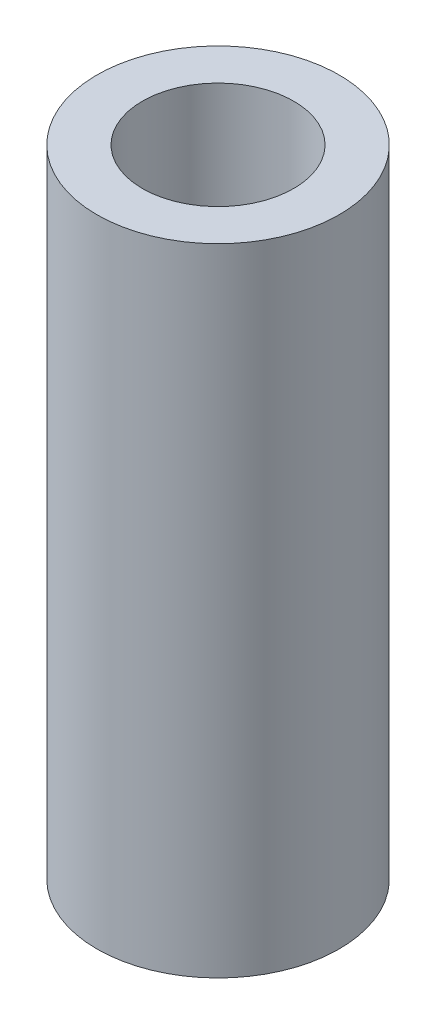
ISO-10303-21;
HEADER;
FILE_DESCRIPTION(('STEP AP214'),'2;1');
FILE_NAME('part.step','',(''),(''),'','','');
FILE_SCHEMA(('AUTOMOTIVE_DESIGN { 1 0 10303 214 1 1 1 1 }'));
ENDSEC;
DATA;
#1=APPLICATION_CONTEXT('core data for automotive mechanical design processes');
#2=APPLICATION_PROTOCOL_DEFINITION('international standard','automotive_design',2000,#1);
#3=PRODUCT_CONTEXT('',#1,'mechanical');
#4=PRODUCT('Part','Part','',(#3));
#5=PRODUCT_RELATED_PRODUCT_CATEGORY('part','',(#4));
#6=PRODUCT_DEFINITION_FORMATION('','',#4);
#7=PRODUCT_DEFINITION_CONTEXT('part definition',#1,'design');
#8=PRODUCT_DEFINITION('design','',#6,#7);
#9=PRODUCT_DEFINITION_SHAPE('','',#8);
#10=(LENGTH_UNIT() NAMED_UNIT(*) SI_UNIT(.MILLI.,.METRE.));
#11=(NAMED_UNIT(*) PLANE_ANGLE_UNIT() SI_UNIT($,.RADIAN.));
#12=(NAMED_UNIT(*) SI_UNIT($,.STERADIAN.) SOLID_ANGLE_UNIT());
#13=UNCERTAINTY_MEASURE_WITH_UNIT(LENGTH_MEASURE(1.E-05),#10,'distance_accuracy_value','');
#14=(GEOMETRIC_REPRESENTATION_CONTEXT(3) GLOBAL_UNCERTAINTY_ASSIGNED_CONTEXT((#13)) GLOBAL_UNIT_ASSIGNED_CONTEXT((#10,
#11,#12)) REPRESENTATION_CONTEXT('',''));
#15=CARTESIAN_POINT('',(0.,0.,0.));
#16=DIRECTION('',(0.,0.,1.));
#17=DIRECTION('',(1.,0.,0.));
#18=AXIS2_PLACEMENT_3D('',#15,#16,#17);
#19=CARTESIAN_POINT('',(0.,21.,0.));
#20=DIRECTION('',(0.,-1.,0.));
#21=DIRECTION('',(0.,0.,-1.));
#22=AXIS2_PLACEMENT_3D('',#19,#20,#21);
#23=CYLINDRICAL_SURFACE('',#22,4.);
#24=DIRECTION('',(0.,-1.,0.));
#25=VECTOR('',#24,1.);
#26=CARTESIAN_POINT('',(-3.99991645107305,21.,-0.0258531320189111));
#27=LINE('',#26,#25);
#28=CARTESIAN_POINT('',(-3.99991645107308,17.399761270919,-0.025853132018911));
#29=VERTEX_POINT('',#28);
#30=CARTESIAN_POINT('',(-3.99991645107308,14.600238729081,-0.025853132018911));
#31=VERTEX_POINT('',#30);
#32=EDGE_CURVE('E11',#29,#31,#27,.T.);
#33=ORIENTED_EDGE('',*,*,#32,.T.);
#34=CARTESIAN_POINT('',(-3.99991645107308,14.600238729081,-0.0258531320190421));
#35=CARTESIAN_POINT('',(-3.99967225830139,14.6009439988238,-0.0640921575293315));
#36=CARTESIAN_POINT('',(-3.99887347610365,14.6032187619792,-0.102278964228953));
#37=CARTESIAN_POINT('',(-3.99620499133585,14.6108738995903,-0.178292419562263));
#38=CARTESIAN_POINT('',(-3.99433556857381,14.6162534626206,-0.216119159673172));
#39=CARTESIAN_POINT('',(-3.98719610185074,14.6369488008378,-0.328422064505284));
#40=CARTESIAN_POINT('',(-3.98039240823535,14.6568271415164,-0.402013757078062));
#41=CARTESIAN_POINT('',(-3.96340813940453,14.7080320373958,-0.544576356502268));
#42=CARTESIAN_POINT('',(-3.95322930854667,14.7393526797706,-0.613549628185836));
#43=CARTESIAN_POINT('',(-3.93052020660311,14.8124834378182,-0.745307835813629));
#44=CARTESIAN_POINT('',(-3.91798857048058,14.8542996475161,-0.808089146927107));
#45=CARTESIAN_POINT('',(-3.89135352945277,14.9489240346771,-0.928050448785724));
#46=CARTESIAN_POINT('',(-3.8772106603566,15.0020634331421,-0.984960294435631));
#47=CARTESIAN_POINT('',(-3.84921378824501,15.1170764566808,-1.08925407411135));
#48=CARTESIAN_POINT('',(-3.83535986056662,15.1789523277724,-1.1366355509169));
#49=CARTESIAN_POINT('',(-3.80908699514521,15.3118854332206,-1.22184578759158));
#50=CARTESIAN_POINT('',(-3.79672101385227,15.3831561146456,-1.2593593716383));
#51=CARTESIAN_POINT('',(-3.77546131742445,15.5315120212514,-1.32173627746362));
#52=CARTESIAN_POINT('',(-3.76656616175619,15.6085948182841,-1.34660484873724));
#53=CARTESIAN_POINT('',(-3.75372261689463,15.7631109656046,-1.38199497149599));
#54=CARTESIAN_POINT('',(-3.74958979642407,15.840405738016,-1.39305292756278));
#55=CARTESIAN_POINT('',(-3.74619639341714,15.9958548095515,-1.40215536416123));
#56=CARTESIAN_POINT('',(-3.74693437342952,16.0740088482956,-1.40020368404321));
#57=CARTESIAN_POINT('',(-3.75302260858192,16.2249354068714,-1.38379454669174));
#58=CARTESIAN_POINT('',(-3.75814713768332,16.2977849538027,-1.36994900946075));
#59=CARTESIAN_POINT('',(-3.77208656020989,16.440062954669,-1.33108421220736));
#60=CARTESIAN_POINT('',(-3.78090196998585,16.5094909284095,-1.30606338874007));
#61=CARTESIAN_POINT('',(-3.8014547569224,16.6446909983725,-1.24498869082329));
#62=CARTESIAN_POINT('',(-3.81325163509311,16.7103504237503,-1.20870621983939));
#63=CARTESIAN_POINT('',(-3.83839332211351,16.8348584792766,-1.12631614578102));
#64=CARTESIAN_POINT('',(-3.85173858055954,16.8937051212682,-1.08020568572731));
#65=CARTESIAN_POINT('',(-3.87940616234065,17.0064550711861,-0.976347097309243));
#66=CARTESIAN_POINT('',(-3.89374063509772,17.0598814916565,-0.918083294265943));
#67=CARTESIAN_POINT('',(-3.92108981098457,17.156325832214,-0.79318088663264));
#68=CARTESIAN_POINT('',(-3.93410407430078,17.1993402902396,-0.726539507591292));
#69=CARTESIAN_POINT('',(-3.95748807810665,17.2739625280279,-0.586005200561402));
#70=CARTESIAN_POINT('',(-3.96783560070064,17.3054753314649,-0.51205802975848));
#71=CARTESIAN_POINT('',(-3.98454566226436,17.3554207033291,-0.359510885329969));
#72=CARTESIAN_POINT('',(-3.99091545014645,17.3738770736394,-0.280919662805801));
#73=CARTESIAN_POINT('',(-3.9963966045933,17.3896748938166,-0.172255891920458));
#74=CARTESIAN_POINT('',(-3.99754872485567,17.3929825667261,-0.143056897965824));
#75=CARTESIAN_POINT('',(-3.99921326658427,17.39775252398,-0.0845341011151192));
#76=CARTESIAN_POINT('',(-3.99972663497742,17.3992175400328,-0.0552105477894228));
#77=CARTESIAN_POINT('',(-3.99991645107305,17.399761270919,-0.0258531320190412));
#78=B_SPLINE_CURVE_WITH_KNOTS('',3,(#34,#35,#36,#37,#38,#39,#40,#41,#42,#43,#44,#45,#46,#47,#48,
#49,#50,#51,#52,#53,#54,#55,#56,#57,#58,#59,#60,#61,#62,#63,#64,#65,#66,#67,#68,#69,#70,#71,#72,
#73,#74,#75,#76,#77),.UNSPECIFIED.,.F.,.F.,(4,2,2,2,2,2,2,2,2,2,2,2,2,2,2,2,2,2,2,2,2,4),(0.,
0.114664507603254,0.229299061720669,0.457701131164789,0.685985340068443,0.9144024051538,
1.15074978367751,1.38715803462588,1.63038942015454,1.87351974714062,2.1068793264695,
2.34017004072909,2.56213147320374,2.78412396825833,3.01095516106762,3.23785238346189,
3.47775904339029,3.71774536497249,3.9596708177997,4.20115409590331,4.28932861164633,
4.37737225545862),.UNSPECIFIED.);
#79=EDGE_CURVE('E83',#31,#29,#78,.T.);
#80=ORIENTED_EDGE('',*,*,#79,.T.);
#81=EDGE_LOOP('',(#33,#80));
#82=FACE_BOUND('',#81,.T.);
#83=DIRECTION('',(0.,-1.,0.));
#84=VECTOR('',#83,1.);
#85=CARTESIAN_POINT('',(-3.99991645107305,21.,0.0258531320189111));
#86=LINE('',#85,#84);
#87=CARTESIAN_POINT('',(-3.99991645107308,14.600238729081,0.025853132018911));
#88=VERTEX_POINT('',#87);
#89=CARTESIAN_POINT('',(-3.99991645107308,17.399761270919,0.025853132018911));
#90=VERTEX_POINT('',#89);
#91=EDGE_CURVE('E45',#88,#90,#86,.F.);
#92=ORIENTED_EDGE('',*,*,#91,.T.);
#93=CARTESIAN_POINT('',(-3.99991645107308,17.399761270919,0.0258531320190421));
#94=CARTESIAN_POINT('',(-3.99967225830139,17.3990560011763,0.0640921575293312));
#95=CARTESIAN_POINT('',(-3.99887347610365,17.3967812380208,0.102278964228953));
#96=CARTESIAN_POINT('',(-3.99620499133585,17.3891261004098,0.178292419562263));
#97=CARTESIAN_POINT('',(-3.99433556857381,17.3837465373795,0.216119159673172));
#98=CARTESIAN_POINT('',(-3.98719610185074,17.3630511991623,0.328422064505283));
#99=CARTESIAN_POINT('',(-3.98039240823535,17.3431728584837,0.40201375707806));
#100=CARTESIAN_POINT('',(-3.96340813940453,17.2919679626042,0.544576356502268));
#101=CARTESIAN_POINT('',(-3.95322930854667,17.2606473202295,0.613549628185838));
#102=CARTESIAN_POINT('',(-3.93052020660311,17.1875165621819,0.74530783581363));
#103=CARTESIAN_POINT('',(-3.91798857048058,17.145700352484,0.808089146927105));
#104=CARTESIAN_POINT('',(-3.89135352945277,17.051075965323,0.928050448785722));
#105=CARTESIAN_POINT('',(-3.8772106603566,16.997936566858,0.98496029443563));
#106=CARTESIAN_POINT('',(-3.84921378824501,16.8829235433193,1.08925407411135));
#107=CARTESIAN_POINT('',(-3.83535986056663,16.8210476722277,1.13663555091689));
#108=CARTESIAN_POINT('',(-3.80908699514521,16.6881145667794,1.22184578759158));
#109=CARTESIAN_POINT('',(-3.79672101385227,16.6168438853544,1.25935937163829));
#110=CARTESIAN_POINT('',(-3.77546131742445,16.4684879787486,1.32173627746362));
#111=CARTESIAN_POINT('',(-3.76656616175619,16.391405181716,1.34660484873724));
#112=CARTESIAN_POINT('',(-3.75372261689463,16.2368890343955,1.38199497149599));
#113=CARTESIAN_POINT('',(-3.74958979642407,16.1595942619841,1.39305292756278));
#114=CARTESIAN_POINT('',(-3.74619639341714,16.0041451904485,1.40215536416123));
#115=CARTESIAN_POINT('',(-3.74693437342952,15.9259911517045,1.40020368404321));
#116=CARTESIAN_POINT('',(-3.75302260858192,15.7750645931286,1.38379454669174));
#117=CARTESIAN_POINT('',(-3.75814713768331,15.7022150461974,1.36994900946075));
#118=CARTESIAN_POINT('',(-3.77208656020989,15.5599370453311,1.33108421220736));
#119=CARTESIAN_POINT('',(-3.78090196998585,15.4905090715906,1.30606338874007));
#120=CARTESIAN_POINT('',(-3.8014547569224,15.3553090016275,1.24498869082329));
#121=CARTESIAN_POINT('',(-3.81325163509311,15.2896495762497,1.20870621983939));
#122=CARTESIAN_POINT('',(-3.83839332211351,15.1651415207234,1.12631614578102));
#123=CARTESIAN_POINT('',(-3.85173858055954,15.1062948787318,1.0802056857273));
#124=CARTESIAN_POINT('',(-3.87940616234065,14.993544928814,0.976347097309244));
#125=CARTESIAN_POINT('',(-3.89374063509773,14.9401185083435,0.918083294265944));
#126=CARTESIAN_POINT('',(-3.92108981098458,14.8436741677861,0.79318088663264));
#127=CARTESIAN_POINT('',(-3.93410407430078,14.8006597097605,0.726539507591293));
#128=CARTESIAN_POINT('',(-3.95748807810665,14.7260374719722,0.586005200561404));
#129=CARTESIAN_POINT('',(-3.96783560070064,14.6945246685351,0.512058029758483));
#130=CARTESIAN_POINT('',(-3.98454566226436,14.644579296671,0.359510885329972));
#131=CARTESIAN_POINT('',(-3.99091545014645,14.6261229263606,0.280919662805803));
#132=CARTESIAN_POINT('',(-3.9963966045933,14.6103251061834,0.17225589192046));
#133=CARTESIAN_POINT('',(-3.99754872485567,14.607017433274,0.143056897965826));
#134=CARTESIAN_POINT('',(-3.99921326658427,14.6022474760201,0.0845341011151206));
#135=CARTESIAN_POINT('',(-3.99972663497742,14.6007824599673,0.0552105477894235));
#136=CARTESIAN_POINT('',(-3.99991645107305,14.600238729081,0.0258531320190412));
#137=B_SPLINE_CURVE_WITH_KNOTS('',3,(#93,#94,#95,#96,#97,#98,#99,#100,#101,#102,#103,#104,#105,
#106,#107,#108,#109,#110,#111,#112,#113,#114,#115,#116,#117,#118,#119,#120,#121,#122,#123,#124,
#125,#126,#127,#128,#129,#130,#131,#132,#133,#134,#135,#136),.UNSPECIFIED.,.F.,.F.,(4,2,2,2,2,2,
2,2,2,2,2,2,2,2,2,2,2,2,2,2,2,4),(0.,0.114664507603254,0.229299061720668,0.457701131164788,
0.685985340068446,0.914402405153799,1.15074978367751,1.38715803462588,1.63038942015453,
1.87351974714062,2.1068793264695,2.34017004072909,2.56213147320374,2.78412396825833,
3.01095516106763,3.23785238346189,3.4777590433903,3.71774536497248,3.95967081779969,
4.20115409590331,4.28932861164633,4.37737225545862),.UNSPECIFIED.);
#138=EDGE_CURVE('E81',#90,#88,#137,.T.);
#139=ORIENTED_EDGE('',*,*,#138,.T.);
#140=EDGE_LOOP('',(#92,#139));
#141=FACE_BOUND('',#140,.T.);
#142=DIRECTION('',(0.,-1.,0.));
#143=VECTOR('',#142,1.);
#144=CARTESIAN_POINT('',(-3.99991645107305,21.,-0.0258531320189111));
#145=LINE('',#144,#143);
#146=CARTESIAN_POINT('',(-3.99991645107316,6.39976127091904,-0.025853132018911));
#147=VERTEX_POINT('',#146);
#148=CARTESIAN_POINT('',(-3.99991645107316,3.60023872908101,-0.025853132018911));
#149=VERTEX_POINT('',#148);
#150=EDGE_CURVE('E78',#147,#149,#145,.T.);
#151=ORIENTED_EDGE('',*,*,#150,.T.);
#152=CARTESIAN_POINT('',(-3.99991645107316,3.60023872908101,-0.0258531320189111));
#153=CARTESIAN_POINT('',(-3.99967225830142,3.60094399882377,-0.0640921575291983));
#154=CARTESIAN_POINT('',(-3.99887347610366,3.6032187619792,-0.102278964228819));
#155=CARTESIAN_POINT('',(-3.99620499133584,3.61087389959025,-0.178292419562128));
#156=CARTESIAN_POINT('',(-3.99433556857381,3.61625346262055,-0.216119159673037));
#157=CARTESIAN_POINT('',(-3.98719610185076,3.63694880083776,-0.328422064505149));
#158=CARTESIAN_POINT('',(-3.98039240823537,3.65682714151634,-0.402013757077929));
#159=CARTESIAN_POINT('',(-3.96340813940455,3.70803203739579,-0.544576356502139));
#160=CARTESIAN_POINT('',(-3.95322930854669,3.73935267977053,-0.61354962818571));
#161=CARTESIAN_POINT('',(-3.93052020660313,3.81248343781812,-0.745307835813509));
#162=CARTESIAN_POINT('',(-3.91798857048061,3.854299647516,-0.808089146926989));
#163=CARTESIAN_POINT('',(-3.8913535294528,3.94892403467695,-0.928050448785614));
#164=CARTESIAN_POINT('',(-3.87721066035663,4.00206343314195,-0.984960294435526));
#165=CARTESIAN_POINT('',(-3.84921378824504,4.11707645668067,-1.08925407411126));
#166=CARTESIAN_POINT('',(-3.83535986056665,4.17895232777225,-1.13663555091681));
#167=CARTESIAN_POINT('',(-3.80908699514523,4.31188543322051,-1.2218457875915));
#168=CARTESIAN_POINT('',(-3.79672101385229,4.38315611464547,-1.25935937163823));
#169=CARTESIAN_POINT('',(-3.77546131742447,4.53151202125127,-1.32173627746357));
#170=CARTESIAN_POINT('',(-3.76656616175621,4.60859481828395,-1.3466048487372));
#171=CARTESIAN_POINT('',(-3.75372261689464,4.76311096560443,-1.38199497149597));
#172=CARTESIAN_POINT('',(-3.74958979642408,4.84040573801585,-1.39305292756276));
#173=CARTESIAN_POINT('',(-3.74619639341714,4.99585480955136,-1.40215536416123));
#174=CARTESIAN_POINT('',(-3.74693437342952,5.07400884829543,-1.40020368404322));
#175=CARTESIAN_POINT('',(-3.75302260858191,5.22493540687129,-1.38379454669176));
#176=CARTESIAN_POINT('',(-3.7581471376833,5.29778495380255,-1.36994900946078));
#177=CARTESIAN_POINT('',(-3.77208656020987,5.44006295466883,-1.33108421220741));
#178=CARTESIAN_POINT('',(-3.78090196998583,5.50949092840937,-1.30606338874012));
#179=CARTESIAN_POINT('',(-3.80145475692238,5.6446909983724,-1.24498869082335));
#180=CARTESIAN_POINT('',(-3.81325163509309,5.71035042375019,-1.20870621983946));
#181=CARTESIAN_POINT('',(-3.83839332211348,5.83485847927652,-1.12631614578111));
#182=CARTESIAN_POINT('',(-3.85173858055951,5.8937051212681,-1.0802056857274));
#183=CARTESIAN_POINT('',(-3.87940616234062,6.00645507118598,-0.976347097309352));
#184=CARTESIAN_POINT('',(-3.8937406350977,6.05988149165643,-0.918083294266058));
#185=CARTESIAN_POINT('',(-3.92108981098455,6.15632583221387,-0.793180886632766));
#186=CARTESIAN_POINT('',(-3.93410407430075,6.19934029023948,-0.726539507591425));
#187=CARTESIAN_POINT('',(-3.95748807810663,6.27396252802781,-0.586005200561544));
#188=CARTESIAN_POINT('',(-3.96783560070062,6.30547533146489,-0.512058029758626));
#189=CARTESIAN_POINT('',(-3.98454566226434,6.35542070332904,-0.359510885330119));
#190=CARTESIAN_POINT('',(-3.99091545014644,6.37387707363939,-0.280919662805951));
#191=CARTESIAN_POINT('',(-3.9963966045933,6.3896748938166,-0.172255891920562));
#192=CARTESIAN_POINT('',(-3.99754872485567,6.3929825667261,-0.14305689796588));
#193=CARTESIAN_POINT('',(-3.99921326658427,6.39775252397999,-0.0845341011150808));
#194=CARTESIAN_POINT('',(-3.99972663497742,6.39921754003277,-0.0552105477893363));
#195=CARTESIAN_POINT('',(-3.99991645107305,6.39976127091905,-0.0258531320189066));
#196=B_SPLINE_CURVE_WITH_KNOTS('',3,(#152,#153,#154,#155,#156,#157,#158,#159,#160,#161,#162,
#163,#164,#165,#166,#167,#168,#169,#170,#171,#172,#173,#174,#175,#176,#177,#178,#179,#180,#181,
#182,#183,#184,#185,#186,#187,#188,#189,#190,#191,#192,#193,#194,#195),.UNSPECIFIED.,.F.,.F.,(4,
2,2,2,2,2,2,2,2,2,2,2,2,2,2,2,2,2,2,2,2,4),(0.,0.114664507603251,0.229299061720663,
0.457701131164782,0.685985340068434,0.914402405153786,1.15074978367749,1.38715803462586,
1.63038942015451,1.8735197471406,2.10687932646949,2.34017004072907,2.56213147320373,
2.78412396825832,3.01095516106761,3.23785238346187,3.47775904339027,3.71774536497246,
3.95967081779967,4.20115409590329,4.28932861164646,4.37737225545889),.UNSPECIFIED.);
#197=EDGE_CURVE('E222',#149,#147,#196,.T.);
#198=ORIENTED_EDGE('',*,*,#197,.T.);
#199=EDGE_LOOP('',(#151,#198));
#200=FACE_BOUND('',#199,.T.);
#201=DIRECTION('',(0.,-1.,0.));
#202=VECTOR('',#201,1.);
#203=CARTESIAN_POINT('',(-3.99991645107305,21.,0.0258531320189111));
#204=LINE('',#203,#202);
#205=CARTESIAN_POINT('',(-3.99991645107316,3.60023872908101,0.025853132018911));
#206=VERTEX_POINT('',#205);
#207=CARTESIAN_POINT('',(-3.99991645107316,6.39976127091904,0.025853132018911));
#208=VERTEX_POINT('',#207);
#209=EDGE_CURVE('E242',#206,#208,#204,.F.);
#210=ORIENTED_EDGE('',*,*,#209,.T.);
#211=CARTESIAN_POINT('',(-3.99991645107316,6.39976127091904,0.0258531320189111));
#212=CARTESIAN_POINT('',(-3.99967225830142,6.39905600117628,0.0640921575291982));
#213=CARTESIAN_POINT('',(-3.99887347610366,6.39678123802085,0.102278964228819));
#214=CARTESIAN_POINT('',(-3.99620499133584,6.38912610040981,0.178292419562127));
#215=CARTESIAN_POINT('',(-3.99433556857381,6.38374653737951,0.216119159673036));
#216=CARTESIAN_POINT('',(-3.98719610185076,6.3630511991623,0.328422064505149));
#217=CARTESIAN_POINT('',(-3.98039240823537,6.34317285848372,0.402013757077927));
#218=CARTESIAN_POINT('',(-3.96340813940455,6.29196796260427,0.544576356502137));
#219=CARTESIAN_POINT('',(-3.95322930854669,6.26064732022953,0.613549628185708));
#220=CARTESIAN_POINT('',(-3.93052020660313,6.18751656218193,0.745307835813506));
#221=CARTESIAN_POINT('',(-3.9179885704806,6.14570035248406,0.808089146926986));
#222=CARTESIAN_POINT('',(-3.8913535294528,6.0510759653231,0.928050448785611));
#223=CARTESIAN_POINT('',(-3.87721066035663,5.99793656685811,0.984960294435523));
#224=CARTESIAN_POINT('',(-3.84921378824504,5.88292354331939,1.08925407411126));
#225=CARTESIAN_POINT('',(-3.83535986056665,5.82104767222781,1.1366355509168));
#226=CARTESIAN_POINT('',(-3.80908699514524,5.68811456677954,1.2218457875915));
#227=CARTESIAN_POINT('',(-3.79672101385229,5.61684388535459,1.25935937163823));
#228=CARTESIAN_POINT('',(-3.77546131742447,5.46848797874879,1.32173627746357));
#229=CARTESIAN_POINT('',(-3.76656616175621,5.39140518171611,1.3466048487372));
#230=CARTESIAN_POINT('',(-3.75372261689464,5.23688903439562,1.38199497149597));
#231=CARTESIAN_POINT('',(-3.74958979642408,5.1595942619842,1.39305292756276));
#232=CARTESIAN_POINT('',(-3.74619639341714,5.00414519044869,1.40215536416123));
#233=CARTESIAN_POINT('',(-3.74693437342952,4.92599115170463,1.40020368404322));
#234=CARTESIAN_POINT('',(-3.75302260858191,4.77506459312876,1.38379454669176));
#235=CARTESIAN_POINT('',(-3.7581471376833,4.70221504619751,1.36994900946078));
#236=CARTESIAN_POINT('',(-3.77208656020987,4.55993704533122,1.33108421220741));
#237=CARTESIAN_POINT('',(-3.78090196998583,4.49050907159068,1.30606338874012));
#238=CARTESIAN_POINT('',(-3.80145475692238,4.35530900162765,1.24498869082335));
#239=CARTESIAN_POINT('',(-3.81325163509309,4.28964957624987,1.20870621983946));
#240=CARTESIAN_POINT('',(-3.83839332211348,4.16514152072353,1.12631614578111));
#241=CARTESIAN_POINT('',(-3.85173858055951,4.10629487873195,1.0802056857274));
#242=CARTESIAN_POINT('',(-3.87940616234062,3.99354492881407,0.976347097309353));
#243=CARTESIAN_POINT('',(-3.8937406350977,3.94011850834362,0.918083294266059));
#244=CARTESIAN_POINT('',(-3.92108981098455,3.84367416778618,0.793180886632768));
#245=CARTESIAN_POINT('',(-3.93410407430075,3.80065970976057,0.726539507591427));
#246=CARTESIAN_POINT('',(-3.95748807810663,3.72603747197224,0.586005200561547));
#247=CARTESIAN_POINT('',(-3.96783560070062,3.69452466853517,0.512058029758628));
#248=CARTESIAN_POINT('',(-3.98454566226434,3.64457929667102,0.359510885330122));
#249=CARTESIAN_POINT('',(-3.99091545014644,3.62612292636067,0.280919662805955));
#250=CARTESIAN_POINT('',(-3.9963966045933,3.61032510618346,0.172255891920565));
#251=CARTESIAN_POINT('',(-3.99754872485567,3.60701743327396,0.143056897965883));
#252=CARTESIAN_POINT('',(-3.99921326658427,3.60224747602007,0.0845341011150814));
#253=CARTESIAN_POINT('',(-3.99972663497742,3.60078245996728,0.0552105477893365));
#254=CARTESIAN_POINT('',(-3.99991645107305,3.60023872908101,0.0258531320189065));
#255=B_SPLINE_CURVE_WITH_KNOTS('',3,(#211,#212,#213,#214,#215,#216,#217,#218,#219,#220,#221,
#222,#223,#224,#225,#226,#227,#228,#229,#230,#231,#232,#233,#234,#235,#236,#237,#238,#239,#240,
#241,#242,#243,#244,#245,#246,#247,#248,#249,#250,#251,#252,#253,#254),.UNSPECIFIED.,.F.,.F.,(4,
2,2,2,2,2,2,2,2,2,2,2,2,2,2,2,2,2,2,2,2,4),(0.,0.114664507603251,0.229299061720663,
0.457701131164781,0.685985340068431,0.914402405153782,1.15074978367749,1.38715803462585,
1.63038942015451,1.8735197471406,2.10687932646949,2.34017004072907,2.56213147320373,
2.78412396825832,3.01095516106761,3.23785238346187,3.47775904339027,3.71774536497246,
3.95967081779967,4.20115409590329,4.28932861164646,4.37737225545889),.UNSPECIFIED.);
#256=EDGE_CURVE('E216',#208,#206,#255,.T.);
#257=ORIENTED_EDGE('',*,*,#256,.T.);
#258=EDGE_LOOP('',(#210,#257));
#259=FACE_BOUND('',#258,.T.);
#260=CARTESIAN_POINT('',(0.,21.,0.));
#261=DIRECTION('',(0.,1.,0.));
#262=DIRECTION('',(0.,0.,1.));
#263=AXIS2_PLACEMENT_3D('',#260,#261,#262);
#264=CIRCLE('',#263,4.);
#265=CARTESIAN_POINT('',(0.,21.,4.));
#266=VERTEX_POINT('',#265);
#267=EDGE_CURVE('E240',#266,#266,#264,.T.);
#268=ORIENTED_EDGE('',*,*,#267,.F.);
#269=EDGE_LOOP('',(#268));
#270=FACE_BOUND('',#269,.T.);
#271=CARTESIAN_POINT('',(0.,0.,0.));
#272=DIRECTION('',(0.,1.,0.));
#273=DIRECTION('',(0.,0.,1.));
#274=AXIS2_PLACEMENT_3D('',#271,#272,#273);
#275=CIRCLE('',#274,4.);
#276=CARTESIAN_POINT('',(0.,0.,4.));
#277=VERTEX_POINT('',#276);
#278=EDGE_CURVE('E120',#277,#277,#275,.T.);
#279=ORIENTED_EDGE('',*,*,#278,.T.);
#280=EDGE_LOOP('',(#279));
#281=FACE_BOUND('',#280,.T.);
#282=ADVANCED_FACE('F37',(#82,#141,#200,#259,#270,#281),#23,.T.);
#283=CARTESIAN_POINT('',(0.,21.,0.));
#284=DIRECTION('',(0.,1.,0.));
#285=DIRECTION('',(0.,0.,1.));
#286=AXIS2_PLACEMENT_3D('',#283,#284,#285);
#287=PLANE('',#286);
#288=CARTESIAN_POINT('',(0.,21.,0.));
#289=DIRECTION('',(0.,1.,0.));
#290=DIRECTION('',(0.,0.,1.));
#291=AXIS2_PLACEMENT_3D('',#288,#289,#290);
#292=CIRCLE('',#291,2.5);
#293=CARTESIAN_POINT('',(0.,21.,2.5));
#294=VERTEX_POINT('',#293);
#295=EDGE_CURVE('E229',#294,#294,#292,.T.);
#296=ORIENTED_EDGE('',*,*,#295,.F.);
#297=EDGE_LOOP('',(#296));
#298=FACE_BOUND('',#297,.T.);
#299=ORIENTED_EDGE('',*,*,#267,.T.);
#300=EDGE_LOOP('',(#299));
#301=FACE_BOUND('',#300,.T.);
#302=ADVANCED_FACE('F143',(#298,#301),#287,.T.);
#303=CARTESIAN_POINT('',(0.,0.,0.));
#304=DIRECTION('',(0.,1.,0.));
#305=DIRECTION('',(0.,0.,1.));
#306=AXIS2_PLACEMENT_3D('',#303,#304,#305);
#307=PLANE('',#306);
#308=CARTESIAN_POINT('',(0.,0.,0.));
#309=DIRECTION('',(0.,-1.,0.));
#310=DIRECTION('',(0.,0.,-1.));
#311=AXIS2_PLACEMENT_3D('',#308,#309,#310);
#312=CIRCLE('',#311,3.2);
#313=CARTESIAN_POINT('',(0.,0.,-3.2));
#314=VERTEX_POINT('',#313);
#315=EDGE_CURVE('E233',#314,#314,#312,.T.);
#316=ORIENTED_EDGE('',*,*,#315,.F.);
#317=EDGE_LOOP('',(#316));
#318=FACE_BOUND('',#317,.T.);
#319=ORIENTED_EDGE('',*,*,#278,.F.);
#320=EDGE_LOOP('',(#319));
#321=FACE_BOUND('',#320,.T.);
#322=ADVANCED_FACE('F141',(#318,#321),#307,.F.);
#323=CARTESIAN_POINT('',(0.,10.,0.));
#324=DIRECTION('',(0.,-1.,0.));
#325=DIRECTION('',(0.,0.,-1.));
#326=AXIS2_PLACEMENT_3D('',#323,#324,#325);
#327=CYLINDRICAL_SURFACE('',#326,3.2);
#328=CARTESIAN_POINT('',(-3.2,3.60000000000002,0.));
#329=CARTESIAN_POINT('',(-3.19999323929896,3.60000882862046,0.0746682325298775));
#330=CARTESIAN_POINT('',(-3.19735695673799,3.60600835816502,0.149436290609146));
#331=CARTESIAN_POINT('',(-3.18706462250722,3.62978490809575,0.296838561834425));
#332=CARTESIAN_POINT('',(-3.17939623551487,3.64759087100718,0.369467071934258));
#333=CARTESIAN_POINT('',(-3.15985979638772,3.69418283092299,0.510210727685957));
#334=CARTESIAN_POINT('',(-3.14800655397558,3.72293013541371,0.57834079637958));
#335=CARTESIAN_POINT('',(-3.12123780515295,3.79042054568872,0.708739295318285));
#336=CARTESIAN_POINT('',(-3.10632305462494,3.82916118473621,0.7710091669143));
#337=CARTESIAN_POINT('',(-3.07400114777708,3.91774957634818,0.891399307299581));
#338=CARTESIAN_POINT('',(-3.05650709697098,3.96805267426737,0.949160930428645));
#339=CARTESIAN_POINT('',(-3.02135131890907,4.07737245601193,1.05574232998401));
#340=CARTESIAN_POINT('',(-3.00368950092187,4.13639413946651,1.10455693955992));
#341=CARTESIAN_POINT('',(-2.9690927777526,4.26543856539599,1.19454701616179));
#342=CARTESIAN_POINT('',(-2.95225267260003,4.33589015374362,1.23514788937881));
#343=CARTESIAN_POINT('',(-2.92260314752168,4.48346132572815,1.30376311363399));
#344=CARTESIAN_POINT('',(-2.9097914452503,4.56057710199087,1.3317845955581));
#345=CARTESIAN_POINT('',(-2.89059965408317,4.71516169742201,1.37292682646117));
#346=CARTESIAN_POINT('',(-2.88392212034105,4.79240748537646,1.38674110526249));
#347=CARTESIAN_POINT('',(-2.87691007594234,4.94838677799436,1.40123529298112));
#348=CARTESIAN_POINT('',(-2.87657152755454,5.02711930365459,1.40192356275211));
#349=CARTESIAN_POINT('',(-2.88202665013976,5.17658359891195,1.39066469697343));
#350=CARTESIAN_POINT('',(-2.88729445733953,5.24742021626037,1.37980117002711));
#351=CARTESIAN_POINT('',(-2.90247226483301,5.38614010882635,1.34757876598954));
#352=CARTESIAN_POINT('',(-2.91238326673219,5.45402274337172,1.32621762435952));
#353=CARTESIAN_POINT('',(-2.93595952759738,5.58670579267017,1.2731835971743));
#354=CARTESIAN_POINT('',(-2.94970322228104,5.65140437146944,1.24129238704281));
#355=CARTESIAN_POINT('',(-2.97938258432282,5.77479985933511,1.16825974889634));
#356=CARTESIAN_POINT('',(-2.99531916026687,5.83349426299944,1.12711448210096));
#357=CARTESIAN_POINT('',(-3.02940997516427,5.94902819970128,1.03220450369383));
#358=CARTESIAN_POINT('',(-3.04763179448214,6.00517368661696,0.977616720899959));
#359=CARTESIAN_POINT('',(-3.08298711786831,6.10775987826215,0.859639861912725));
#360=CARTESIAN_POINT('',(-3.10012031174763,6.15419782551534,0.796248293446521));
#361=CARTESIAN_POINT('',(-3.13196210037405,6.23721440381238,0.66016925228355));
#362=CARTESIAN_POINT('',(-3.14659001099467,6.2734829128974,0.587272278263271));
#363=CARTESIAN_POINT('',(-3.17114037284155,6.33299309785246,0.435607390856095));
#364=CARTESIAN_POINT('',(-3.18106569682268,6.35624272838524,0.356843095870493));
#365=CARTESIAN_POINT('',(-3.1945388332546,6.38753830009636,0.201455047470969));
#366=CARTESIAN_POINT('',(-3.19847581943999,6.39651393340044,0.125052333509547));
#367=CARTESIAN_POINT('',(-3.2007922664932,6.40181271555229,-0.0282640651341215));
#368=CARTESIAN_POINT('',(-3.19917353770823,6.39813998590759,-0.10517757521984));
#369=CARTESIAN_POINT('',(-3.19080873687224,6.37888616161881,-0.252793729037831));
#370=CARTESIAN_POINT('',(-3.18435437244214,6.36398229289883,-0.323603206184578));
#371=CARTESIAN_POINT('',(-3.1672925050764,6.3236594347154,-0.461624114121053));
#372=CARTESIAN_POINT('',(-3.15668449196048,6.29823915353068,-0.52883510176584));
#373=CARTESIAN_POINT('',(-3.13190520783963,6.23678768417317,-0.660132529349556));
#374=CARTESIAN_POINT('',(-3.11763295400634,6.20044975949184,-0.724055715670428));
#375=CARTESIAN_POINT('',(-3.08701554400474,6.11852910687444,-0.845127836893712));
#376=CARTESIAN_POINT('',(-3.07066949286605,6.07294238239581,-0.902273826296681));
#377=CARTESIAN_POINT('',(-3.03606354570034,5.96965439698898,-1.0128843281988));
#378=CARTESIAN_POINT('',(-3.01775402187564,5.91128397486417,-1.06571002168735));
#379=CARTESIAN_POINT('',(-2.98238476439398,5.78626291589081,-1.16102178855706));
#380=CARTESIAN_POINT('',(-2.96532543173475,5.71960964064346,-1.20350455451119));
#381=CARTESIAN_POINT('',(-2.93414786375579,5.57799844717799,-1.27766771000143));
#382=CARTESIAN_POINT('',(-2.92009882997794,5.50289565303897,-1.30910280610461));
#383=CARTESIAN_POINT('',(-2.89741141326388,5.34764857374586,-1.35858805747395));
#384=CARTESIAN_POINT('',(-2.88876794930699,5.26750910109906,-1.37665078517921));
#385=CARTESIAN_POINT('',(-2.87870059545969,5.11161889436916,-1.39757122414597));
#386=CARTESIAN_POINT('',(-2.87673758203622,5.03605511942191,-1.40156534379494));
#387=CARTESIAN_POINT('',(-2.87879673024831,4.88536230259502,-1.39733172107155));
#388=CARTESIAN_POINT('',(-2.8828177181642,4.81023317836314,-1.38910637546167));
#389=CARTESIAN_POINT('',(-2.89587822994622,4.66694548881129,-1.36165261619709));
#390=CARTESIAN_POINT('',(-2.90462124077084,4.59863295391721,-1.34307241616426));
#391=CARTESIAN_POINT('',(-2.92587878716624,4.46609672226217,-1.29610727139735));
#392=CARTESIAN_POINT('',(-2.93839440474458,4.40187420495353,-1.26771951345155));
#393=CARTESIAN_POINT('',(-2.96676558143144,4.2748988493906,-1.19988864897201));
#394=CARTESIAN_POINT('',(-2.98278224731329,4.21249548508154,-1.1598601773472));
#395=CARTESIAN_POINT('',(-3.0159494898889,4.09493768917059,-1.0706593907491));
#396=CARTESIAN_POINT('',(-3.03310051918632,4.03978617755641,-1.02148341162247));
#397=CARTESIAN_POINT('',(-3.06832603234553,3.93353609988187,-0.910514271123461));
#398=CARTESIAN_POINT('',(-3.08635772876448,3.88316263349807,-0.848009730462911));
#399=CARTESIAN_POINT('',(-3.11990113043651,3.79355326264327,-0.714792550563451));
#400=CARTESIAN_POINT('',(-3.13541168934315,3.75432241863165,-0.644076202378754));
#401=CARTESIAN_POINT('',(-3.16200691540381,3.68882772121614,-0.497203699003514));
#402=CARTESIAN_POINT('',(-3.17314582493306,3.66240392533636,-0.42112899753792));
#403=CARTESIAN_POINT('',(-3.18995281447474,3.6230014036058,-0.265147894197037));
#404=CARTESIAN_POINT('',(-3.19563769617754,3.60998137696073,-0.18525406117933));
#405=CARTESIAN_POINT('',(-3.19942859954671,3.60130795436467,-0.0699772697921454));
#406=CARTESIAN_POINT('',(-3.20000316897606,3.59999586171811,-0.0349996013486818));
#407=CARTESIAN_POINT('',(-3.2,3.60000000000002,0.));
#408=B_SPLINE_CURVE_WITH_KNOTS('',3,(#328,#329,#330,#331,#332,#333,#334,#335,#336,#337,#338,
#339,#340,#341,#342,#343,#344,#345,#346,#347,#348,#349,#350,#351,#352,#353,#354,#355,#356,#357,
#358,#359,#360,#361,#362,#363,#364,#365,#366,#367,#368,#369,#370,#371,#372,#373,#374,#375,#376,
#377,#378,#379,#380,#381,#382,#383,#384,#385,#386,#387,#388,#389,#390,#391,#392,#393,#394,#395,
#396,#397,#398,#399,#400,#401,#402,#403,#404,#405,#406,#407),.UNSPECIFIED.,.T.,.F.,(4,2,2,2,2,2,
2,2,2,2,2,2,2,2,2,2,2,2,2,2,2,2,2,2,2,2,2,2,2,2,2,2,2,2,2,2,2,2,2,4),(0.,0.22389784388117,
0.448346594706908,0.672008880095001,0.895616009826726,1.1303060725882,1.36513124343025,
1.61299389023415,1.86071585303957,2.09567060708281,2.33047569735744,2.54504901527542,
2.75966864114528,2.97905125230743,3.19852503646187,3.43864747577074,3.67883803068161,
3.92570866035185,4.17242828458789,4.4023023507457,4.63210151882834,4.84905357520543,
5.06603228751983,5.28979086692528,5.5136463424347,5.7550333097822,5.99649736596454,
6.24302657717685,6.48932371106909,6.7152018646058,6.94103571957449,7.15410460735167,
7.3672346628778,7.59383609576229,7.82052849302986,8.06618640407504,8.3119557037418,
8.55457109012829,8.7964366520339,8.90138537002498),.UNSPECIFIED.);
#409=CARTESIAN_POINT('',(-3.2,3.60000000000002,0.));
#410=VERTEX_POINT('',#409);
#411=EDGE_CURVE('E89',#410,#410,#408,.T.);
#412=ORIENTED_EDGE('',*,*,#411,.T.);
#413=EDGE_LOOP('',(#412));
#414=FACE_BOUND('',#413,.T.);
#415=CARTESIAN_POINT('',(0.,10.,0.));
#416=DIRECTION('',(0.,-1.,0.));
#417=DIRECTION('',(0.,0.,-1.));
#418=AXIS2_PLACEMENT_3D('',#415,#416,#417);
#419=CIRCLE('',#418,3.2);
#420=CARTESIAN_POINT('',(0.,10.,-3.2));
#421=VERTEX_POINT('',#420);
#422=EDGE_CURVE('E236',#421,#421,#419,.T.);
#423=ORIENTED_EDGE('',*,*,#422,.F.);
#424=EDGE_LOOP('',(#423));
#425=FACE_BOUND('',#424,.T.);
#426=ORIENTED_EDGE('',*,*,#315,.T.);
#427=EDGE_LOOP('',(#426));
#428=FACE_BOUND('',#427,.T.);
#429=ADVANCED_FACE('F136',(#414,#425,#428),#327,.F.);
#430=CARTESIAN_POINT('',(0.,10.,0.));
#431=DIRECTION('',(0.,-1.,0.));
#432=DIRECTION('',(0.,0.,-1.));
#433=AXIS2_PLACEMENT_3D('',#430,#431,#432);
#434=PLANE('',#433);
#435=ORIENTED_EDGE('',*,*,#422,.T.);
#436=EDGE_LOOP('',(#435));
#437=FACE_BOUND('',#436,.T.);
#438=ADVANCED_FACE('F133',(#437),#434,.T.);
#439=CARTESIAN_POINT('',(0.,11.,0.));
#440=DIRECTION('',(0.,1.,0.));
#441=DIRECTION('',(0.,0.,1.));
#442=AXIS2_PLACEMENT_3D('',#439,#440,#441);
#443=CYLINDRICAL_SURFACE('',#442,2.5);
#444=CARTESIAN_POINT('',(-2.5,14.6,0.));
#445=CARTESIAN_POINT('',(-2.5000025207769,14.5999971034013,0.0725818689730917));
#446=CARTESIAN_POINT('',(-2.4968126130914,14.6056686696437,0.145147059210999));
#447=CARTESIAN_POINT('',(-2.48438893882109,14.6280397874394,0.288016997267103));
#448=CARTESIAN_POINT('',(-2.47515440964292,14.6447407304683,0.358321458696011));
#449=CARTESIAN_POINT('',(-2.4515826362878,14.6882875901928,0.494475170763167));
#450=CARTESIAN_POINT('',(-2.4372642045506,14.7150961271458,0.560339795458177));
#451=CARTESIAN_POINT('',(-2.40477714167671,14.7778409702233,0.68651047810435));
#452=CARTESIAN_POINT('',(-2.38660756789145,14.8137795115382,0.746815169948827));
#453=CARTESIAN_POINT('',(-2.34650853836439,14.8965929323298,0.864901258370252));
#454=CARTESIAN_POINT('',(-2.32440463450632,14.9440586544967,0.922207928188874));
#455=CARTESIAN_POINT('',(-2.27936832535399,15.047278741539,1.02850336667495));
#456=CARTESIAN_POINT('',(-2.25643508622408,15.1030416344692,1.07748346476577));
#457=CARTESIAN_POINT('',(-2.20954965541892,15.228110571729,1.17085060892693));
#458=CARTESIAN_POINT('',(-2.18573723286096,15.2982207513902,1.21423931000865));
#459=CARTESIAN_POINT('',(-2.14285181690115,15.446118759996,1.28842263311707));
#460=CARTESIAN_POINT('',(-2.12377195324334,15.5238952276818,1.31923555387748));
#461=CARTESIAN_POINT('',(-2.09675966314441,15.6679140789319,1.3616501036544));
#462=CARTESIAN_POINT('',(-2.08731773527896,15.733079335676,1.37594726130742));
#463=CARTESIAN_POINT('',(-2.07456424572643,15.8653466905762,1.3951063945149));
#464=CARTESIAN_POINT('',(-2.0712465008732,15.9324467656657,1.39997788675499));
#465=CARTESIAN_POINT('',(-2.07121661581743,16.06672736888,1.40002199297853));
#466=CARTESIAN_POINT('',(-2.07451218307788,16.1339078995773,1.39518329024686));
#467=CARTESIAN_POINT('',(-2.08724063955166,16.2663252466788,1.37606434146031));
#468=CARTESIAN_POINT('',(-2.09667758202417,16.3315607496216,1.3617778598451));
#469=CARTESIAN_POINT('',(-2.12044163026771,16.4584357281997,1.32446590427588));
#470=CARTESIAN_POINT('',(-2.13476453162494,16.5200782424142,1.30144794194266));
#471=CARTESIAN_POINT('',(-2.16675385560416,16.6388266018562,1.24746154369203));
#472=CARTESIAN_POINT('',(-2.18442157705475,16.6959306724878,1.21649001765185));
#473=CARTESIAN_POINT('',(-2.22441210553114,16.81333339005,1.14194614545547));
#474=CARTESIAN_POINT('',(-2.24703255727838,16.8727655212571,1.09716690393685));
#475=CARTESIAN_POINT('',(-2.29245003438463,16.9838179532412,0.9988049017344));
#476=CARTESIAN_POINT('',(-2.31524718798208,17.0354318843283,0.945215036141926));
#477=CARTESIAN_POINT('',(-2.36128035281545,17.1348052671212,0.824002455402962));
#478=CARTESIAN_POINT('',(-2.38431210459901,17.1815943321778,0.755497761421244));
#479=CARTESIAN_POINT('',(-2.42556670348269,17.262773509807,0.610176383485678));
#480=CARTESIAN_POINT('',(-2.44379268366085,17.2971717058745,0.533365161191363));
#481=CARTESIAN_POINT('',(-2.47222426509628,17.3499447244115,0.379219300123219));
#482=CARTESIAN_POINT('',(-2.48290475975753,17.3692783180377,0.302303425618088));
#483=CARTESIAN_POINT('',(-2.49698582081013,17.3946518880584,0.145680772914424));
#484=CARTESIAN_POINT('',(-2.5003930189659,17.4007039746224,0.0659766045407315));
#485=CARTESIAN_POINT('',(-2.49958253553248,17.3992526196861,-0.0840088573455042));
#486=CARTESIAN_POINT('',(-2.49620041503358,17.3932347104734,-0.154314771743418));
#487=CARTESIAN_POINT('',(-2.48377435305127,17.3708471787942,-0.292732551809142));
#488=CARTESIAN_POINT('',(-2.47473025019386,17.3544772612816,-0.360844354883694));
#489=CARTESIAN_POINT('',(-2.45186816628827,17.3122383189219,-0.492752800665483));
#490=CARTESIAN_POINT('',(-2.43807634930447,17.2864213077176,-0.556570848252344));
#491=CARTESIAN_POINT('',(-2.40684706634307,17.2262033961865,-0.679033093012461));
#492=CARTESIAN_POINT('',(-2.38940865264309,17.1918002639425,-0.737675939545725));
#493=CARTESIAN_POINT('',(-2.35026880598828,17.1113616431687,-0.854647586363548));
#494=CARTESIAN_POINT('',(-2.32831298394221,17.0644909391045,-0.91231623341386));
#495=CARTESIAN_POINT('',(-2.28345593500925,16.962431001857,-1.01941549241508));
#496=CARTESIAN_POINT('',(-2.26055367606601,16.9072325038943,-1.06883679847808));
#497=CARTESIAN_POINT('',(-2.21357993795462,16.7833012556651,-1.16323731293619));
#498=CARTESIAN_POINT('',(-2.18963369204043,16.7137584760601,-1.20722360376429));
#499=CARTESIAN_POINT('',(-2.14628222162434,16.566931533571,-1.28272281277869));
#500=CARTESIAN_POINT('',(-2.12687067777325,16.4896583606332,-1.31425313191436));
#501=CARTESIAN_POINT('',(-2.09903909958624,16.3461566386078,-1.35814700997933));
#502=CARTESIAN_POINT('',(-2.08916693682541,16.2810161676394,-1.37314501906902));
#503=CARTESIAN_POINT('',(-2.07552058815552,16.1486607049443,-1.39369032223819));
#504=CARTESIAN_POINT('',(-2.07174007587244,16.0814479394138,-1.39924742133139));
#505=CARTESIAN_POINT('',(-2.0708191382455,15.9467806386368,-1.40061028195422));
#506=CARTESIAN_POINT('',(-2.07368831900492,15.8793258943516,-1.39640193637516));
#507=CARTESIAN_POINT('',(-2.08566145783698,15.7462537804279,-1.37845110967394));
#508=CARTESIAN_POINT('',(-2.09476940152745,15.680637613269,-1.36470253372663));
#509=CARTESIAN_POINT('',(-2.11792732652032,15.5533246916661,-1.32847150200962));
#510=CARTESIAN_POINT('',(-2.13194325635333,15.491604304692,-1.30604911543395));
#511=CARTESIAN_POINT('',(-2.16340129463321,15.3726207113778,-1.25325063054657));
#512=CARTESIAN_POINT('',(-2.1808447087003,15.3153592151908,-1.22287149982576));
#513=CARTESIAN_POINT('',(-2.22040526472663,15.1976762316304,-1.14968661812875));
#514=CARTESIAN_POINT('',(-2.24282990054019,15.1380951250878,-1.10569440990223));
#515=CARTESIAN_POINT('',(-2.28798739767773,15.0266105148073,-1.00894376720332));
#516=CARTESIAN_POINT('',(-2.31072049582112,14.9747133225061,-0.956178201133433));
#517=CARTESIAN_POINT('',(-2.35688482150115,14.8743424399434,-0.836446621131476));
#518=CARTESIAN_POINT('',(-2.38011931516563,14.8268679680855,-0.768557958915544));
#519=CARTESIAN_POINT('',(-2.42193730695592,14.7441923865163,-0.624371405225465));
#520=CARTESIAN_POINT('',(-2.44052357837762,14.7089839534941,-0.548078567315729));
#521=CARTESIAN_POINT('',(-2.4698645459765,14.654367800848,-0.394320657231997));
#522=CARTESIAN_POINT('',(-2.4810485262019,14.6340843630634,-0.317251581329477));
#523=CARTESIAN_POINT('',(-2.49611160908086,14.6069080250896,-0.160113082948897));
#524=CARTESIAN_POINT('',(-2.4999972199791,14.6000031944934,-0.0800463986147522));
#525=CARTESIAN_POINT('',(-2.5,14.6,0.));
#526=B_SPLINE_CURVE_WITH_KNOTS('',3,(#444,#445,#446,#447,#448,#449,#450,#451,#452,#453,#454,
#455,#456,#457,#458,#459,#460,#461,#462,#463,#464,#465,#466,#467,#468,#469,#470,#471,#472,#473,
#474,#475,#476,#477,#478,#479,#480,#481,#482,#483,#484,#485,#486,#487,#488,#489,#490,#491,#492,
#493,#494,#495,#496,#497,#498,#499,#500,#501,#502,#503,#504,#505,#506,#507,#508,#509,#510,#511,
#512,#513,#514,#515,#516,#517,#518,#519,#520,#521,#522,#523,#524,#525),.UNSPECIFIED.,.T.,.F.,(4,
2,2,2,2,2,2,2,2,2,2,2,2,2,2,2,2,2,2,2,2,2,2,2,2,2,2,2,2,2,2,2,2,2,2,2,2,2,2,2,4),(0.,
0.217435512517166,0.434898462127869,0.651564958945524,0.868284550848014,1.10022589213456,
1.33240729712488,1.58859231253333,1.84440321838644,2.04566432080885,2.24672211236853,
2.44801436216047,2.64943959816538,2.85069194125704,3.05202259362405,3.28441685131826,
3.51699943986532,3.77394969791921,4.03073202312733,4.26940910410352,4.50786846709433,
4.71877390395926,4.92968535218223,5.13945262304555,5.34927447871155,5.58080367166494,
5.81259236960018,6.06843034205975,6.32390963505653,6.52574183023126,6.72736428079795,
6.92927817535459,7.13132118254213,7.33198932166182,7.53273404934171,7.76395996958625,
7.99537477361486,8.25216210224235,8.50879585486681,8.74880719470861,8.98860440514424),.UNSPECIFIED.);
#527=CARTESIAN_POINT('',(-2.5,14.6,0.));
#528=VERTEX_POINT('',#527);
#529=EDGE_CURVE('E87',#528,#528,#526,.T.);
#530=ORIENTED_EDGE('',*,*,#529,.T.);
#531=EDGE_LOOP('',(#530));
#532=FACE_BOUND('',#531,.T.);
#533=CARTESIAN_POINT('',(0.,11.,0.));
#534=DIRECTION('',(0.,1.,0.));
#535=DIRECTION('',(0.,0.,1.));
#536=AXIS2_PLACEMENT_3D('',#533,#534,#535);
#537=CIRCLE('',#536,2.5);
#538=CARTESIAN_POINT('',(0.,11.,2.5));
#539=VERTEX_POINT('',#538);
#540=EDGE_CURVE('E230',#539,#539,#537,.T.);
#541=ORIENTED_EDGE('',*,*,#540,.F.);
#542=EDGE_LOOP('',(#541));
#543=FACE_BOUND('',#542,.T.);
#544=ORIENTED_EDGE('',*,*,#295,.T.);
#545=EDGE_LOOP('',(#544));
#546=FACE_BOUND('',#545,.T.);
#547=ADVANCED_FACE('F127',(#532,#543,#546),#443,.F.);
#548=CARTESIAN_POINT('',(0.,11.,0.));
#549=DIRECTION('',(0.,1.,0.));
#550=DIRECTION('',(0.,0.,1.));
#551=AXIS2_PLACEMENT_3D('',#548,#549,#550);
#552=PLANE('',#551);
#553=ORIENTED_EDGE('',*,*,#540,.T.);
#554=EDGE_LOOP('',(#553));
#555=FACE_BOUND('',#554,.T.);
#556=ADVANCED_FACE('F132',(#555),#552,.T.);
#557=CARTESIAN_POINT('',(-3.99991645107308,16.,0.));
#558=DIRECTION('',(-1.,0.,0.));
#559=DIRECTION('',(0.,-1.,0.));
#560=AXIS2_PLACEMENT_3D('',#557,#558,#559);
#561=PLANE('',#560);
#562=CARTESIAN_POINT('',(-3.99991645107308,16.,0.));
#563=DIRECTION('',(-1.,0.,0.));
#564=DIRECTION('',(0.,-1.,0.));
#565=AXIS2_PLACEMENT_3D('',#562,#563,#564);
#566=CIRCLE('',#565,1.4);
#567=EDGE_CURVE('E57',#90,#29,#566,.T.);
#568=ORIENTED_EDGE('',*,*,#567,.F.);
#569=ORIENTED_EDGE('',*,*,#91,.F.);
#570=EDGE_CURVE('E52',#31,#88,#566,.T.);
#571=ORIENTED_EDGE('',*,*,#570,.F.);
#572=ORIENTED_EDGE('',*,*,#32,.F.);
#573=EDGE_LOOP('',(#568,#569,#571,#572));
#574=FACE_BOUND('',#573,.T.);
#575=ADVANCED_FACE('F75',(#574),#561,.F.);
#576=CARTESIAN_POINT('',(-1.99991645107308,16.,0.));
#577=DIRECTION('',(-1.,0.,0.));
#578=DIRECTION('',(0.,-1.,0.));
#579=AXIS2_PLACEMENT_3D('',#576,#577,#578);
#580=CYLINDRICAL_SURFACE('',#579,1.4);
#581=ORIENTED_EDGE('',*,*,#529,.F.);
#582=EDGE_LOOP('',(#581));
#583=FACE_BOUND('',#582,.T.);
#584=ORIENTED_EDGE('',*,*,#570,.T.);
#585=ORIENTED_EDGE('',*,*,#138,.F.);
#586=ORIENTED_EDGE('',*,*,#567,.T.);
#587=ORIENTED_EDGE('',*,*,#79,.F.);
#588=EDGE_LOOP('',(#584,#585,#586,#587));
#589=FACE_BOUND('',#588,.T.);
#590=ADVANCED_FACE('F80',(#583,#589),#580,.F.);
#591=CARTESIAN_POINT('',(-3.99991645107316,5.00000000000003,0.));
#592=DIRECTION('',(-1.,0.,0.));
#593=DIRECTION('',(0.,-1.,0.));
#594=AXIS2_PLACEMENT_3D('',#591,#592,#593);
#595=PLANE('',#594);
#596=CARTESIAN_POINT('',(-3.99991645107316,5.00000000000003,0.));
#597=DIRECTION('',(-1.,0.,0.));
#598=DIRECTION('',(0.,-1.,0.));
#599=AXIS2_PLACEMENT_3D('',#596,#597,#598);
#600=CIRCLE('',#599,1.4);
#601=EDGE_CURVE('E84',#208,#147,#600,.T.);
#602=ORIENTED_EDGE('',*,*,#601,.F.);
#603=ORIENTED_EDGE('',*,*,#209,.F.);
#604=EDGE_CURVE('E99',#149,#206,#600,.T.);
#605=ORIENTED_EDGE('',*,*,#604,.F.);
#606=ORIENTED_EDGE('',*,*,#150,.F.);
#607=EDGE_LOOP('',(#602,#603,#605,#606));
#608=FACE_BOUND('',#607,.T.);
#609=ADVANCED_FACE('F109',(#608),#595,.F.);
#610=CARTESIAN_POINT('',(-1.99991645107316,5.00000000000001,0.));
#611=DIRECTION('',(-1.,0.,0.));
#612=DIRECTION('',(0.,-1.,0.));
#613=AXIS2_PLACEMENT_3D('',#610,#611,#612);
#614=CYLINDRICAL_SURFACE('',#613,1.4);
#615=ORIENTED_EDGE('',*,*,#411,.F.);
#616=EDGE_LOOP('',(#615));
#617=FACE_BOUND('',#616,.T.);
#618=ORIENTED_EDGE('',*,*,#604,.T.);
#619=ORIENTED_EDGE('',*,*,#256,.F.);
#620=ORIENTED_EDGE('',*,*,#601,.T.);
#621=ORIENTED_EDGE('',*,*,#197,.F.);
#622=EDGE_LOOP('',(#618,#619,#620,#621));
#623=FACE_BOUND('',#622,.T.);
#624=ADVANCED_FACE('F193',(#617,#623),#614,.F.);
#625=CLOSED_SHELL('',(#282,#302,#322,#429,#438,#547,#556,#575,#590,#609,#624));
#626=MANIFOLD_SOLID_BREP('B2',#625);
#627=ADVANCED_BREP_SHAPE_REPRESENTATION('',(#18,#626),#14);
#628=SHAPE_DEFINITION_REPRESENTATION(#9,#627);
ENDSEC;
END-ISO-10303-21;
